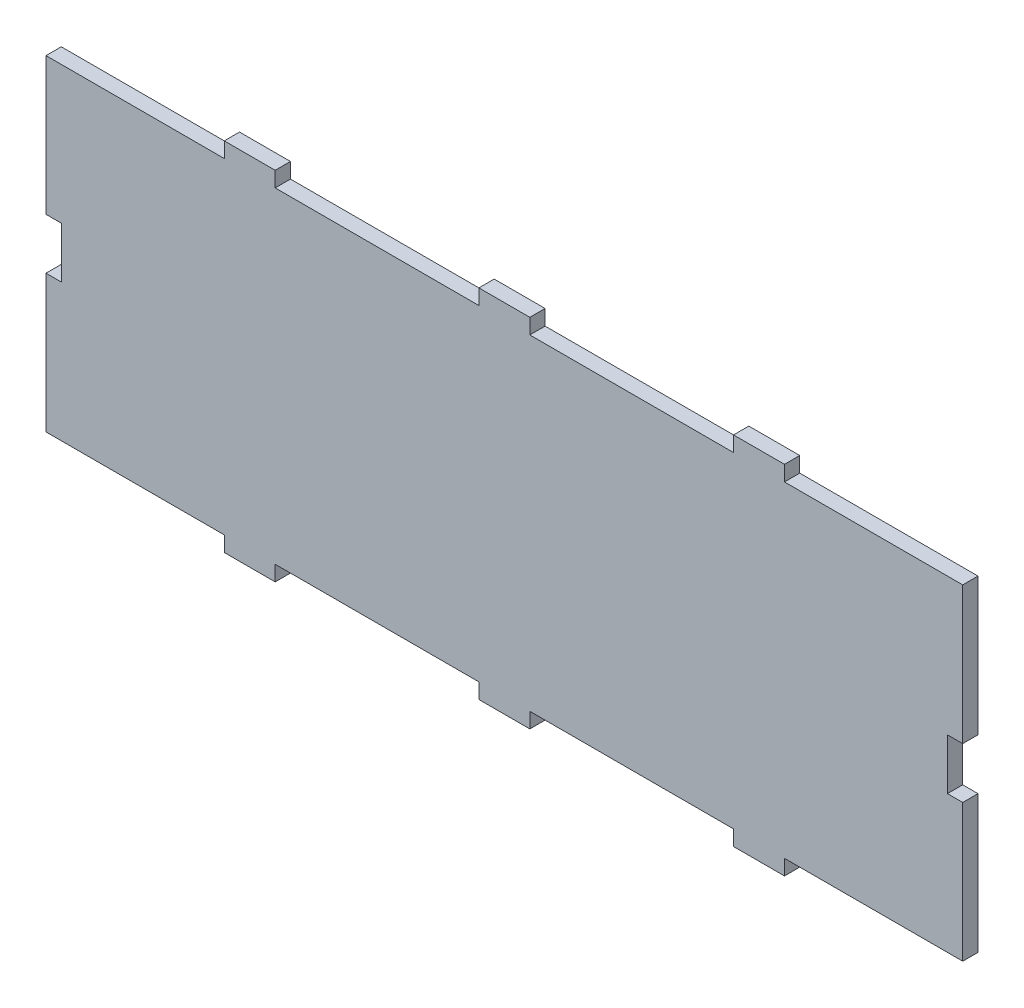
ISO-10303-21;
HEADER;
FILE_DESCRIPTION(('STEP AP214'),'2;1');
FILE_NAME('part.step','',(''),(''),'','','');
FILE_SCHEMA(('AUTOMOTIVE_DESIGN { 1 0 10303 214 1 1 1 1 }'));
ENDSEC;
DATA;
#1=APPLICATION_CONTEXT('core data for automotive mechanical design processes');
#2=APPLICATION_PROTOCOL_DEFINITION('international standard','automotive_design',2000,#1);
#3=PRODUCT_CONTEXT('',#1,'mechanical');
#4=PRODUCT('Part','Part','',(#3));
#5=PRODUCT_RELATED_PRODUCT_CATEGORY('part','',(#4));
#6=PRODUCT_DEFINITION_FORMATION('','',#4);
#7=PRODUCT_DEFINITION_CONTEXT('part definition',#1,'design');
#8=PRODUCT_DEFINITION('design','',#6,#7);
#9=PRODUCT_DEFINITION_SHAPE('','',#8);
#10=(LENGTH_UNIT() NAMED_UNIT(*) SI_UNIT(.MILLI.,.METRE.));
#11=(NAMED_UNIT(*) PLANE_ANGLE_UNIT() SI_UNIT($,.RADIAN.));
#12=(NAMED_UNIT(*) SI_UNIT($,.STERADIAN.) SOLID_ANGLE_UNIT());
#13=UNCERTAINTY_MEASURE_WITH_UNIT(LENGTH_MEASURE(1.E-05),#10,'distance_accuracy_value','');
#14=(GEOMETRIC_REPRESENTATION_CONTEXT(3) GLOBAL_UNCERTAINTY_ASSIGNED_CONTEXT((#13)) GLOBAL_UNIT_ASSIGNED_CONTEXT((#10,
#11,#12)) REPRESENTATION_CONTEXT('',''));
#15=CARTESIAN_POINT('',(0.,0.,0.));
#16=DIRECTION('',(0.,0.,1.));
#17=DIRECTION('',(1.,0.,0.));
#18=AXIS2_PLACEMENT_3D('',#15,#16,#17);
#19=CARTESIAN_POINT('',(90.,-35.,3.));
#20=DIRECTION('',(-1.,0.,0.));
#21=DIRECTION('',(0.,0.,1.));
#22=AXIS2_PLACEMENT_3D('',#19,#20,#21);
#23=PLANE('',#22);
#24=DIRECTION('',(0.,0.,1.));
#25=VECTOR('',#24,1.);
#26=CARTESIAN_POINT('',(90.,-32.,-7.));
#27=LINE('',#26,#25);
#28=CARTESIAN_POINT('',(90.,-32.,0.));
#29=VERTEX_POINT('',#28);
#30=CARTESIAN_POINT('',(90.,-32.,3.));
#31=VERTEX_POINT('',#30);
#32=EDGE_CURVE('E355',#29,#31,#27,.T.);
#33=ORIENTED_EDGE('',*,*,#32,.F.);
#34=DIRECTION('',(0.,1.,0.));
#35=VECTOR('',#34,1.);
#36=CARTESIAN_POINT('',(90.,-35.,0.));
#37=LINE('',#36,#35);
#38=CARTESIAN_POINT('',(90.,-5.,0.));
#39=VERTEX_POINT('',#38);
#40=EDGE_CURVE('E475',#29,#39,#37,.T.);
#41=ORIENTED_EDGE('',*,*,#40,.T.);
#42=DIRECTION('',(0.,0.,1.));
#43=VECTOR('',#42,1.);
#44=CARTESIAN_POINT('',(90.,-5.,0.));
#45=LINE('',#44,#43);
#46=CARTESIAN_POINT('',(90.,-5.,3.));
#47=VERTEX_POINT('',#46);
#48=EDGE_CURVE('E456',#39,#47,#45,.T.);
#49=ORIENTED_EDGE('',*,*,#48,.T.);
#50=DIRECTION('',(0.,1.,0.));
#51=VECTOR('',#50,1.);
#52=CARTESIAN_POINT('',(90.,-35.,3.));
#53=LINE('',#52,#51);
#54=EDGE_CURVE('E460',#31,#47,#53,.T.);
#55=ORIENTED_EDGE('',*,*,#54,.F.);
#56=EDGE_LOOP('',(#33,#41,#49,#55));
#57=FACE_BOUND('',#56,.T.);
#58=ADVANCED_FACE('F39',(#57),#23,.F.);
#59=CARTESIAN_POINT('',(-90.,-35.,3.));
#60=DIRECTION('',(1.,0.,0.));
#61=DIRECTION('',(0.,0.,-1.));
#62=AXIS2_PLACEMENT_3D('',#59,#60,#61);
#63=PLANE('',#62);
#64=DIRECTION('',(0.,0.,1.));
#65=VECTOR('',#64,1.);
#66=CARTESIAN_POINT('',(-90.,32.,-7.));
#67=LINE('',#66,#65);
#68=CARTESIAN_POINT('',(-90.,32.,0.));
#69=VERTEX_POINT('',#68);
#70=CARTESIAN_POINT('',(-90.,32.,3.));
#71=VERTEX_POINT('',#70);
#72=EDGE_CURVE('E373',#69,#71,#67,.T.);
#73=ORIENTED_EDGE('',*,*,#72,.F.);
#74=DIRECTION('',(0.,-1.,0.));
#75=VECTOR('',#74,1.);
#76=CARTESIAN_POINT('',(-90.,-35.,0.));
#77=LINE('',#76,#75);
#78=CARTESIAN_POINT('',(-90.,5.,0.));
#79=VERTEX_POINT('',#78);
#80=EDGE_CURVE('E482',#69,#79,#77,.T.);
#81=ORIENTED_EDGE('',*,*,#80,.T.);
#82=DIRECTION('',(0.,0.,1.));
#83=VECTOR('',#82,1.);
#84=CARTESIAN_POINT('',(-90.,5.,0.));
#85=LINE('',#84,#83);
#86=CARTESIAN_POINT('',(-90.,5.,3.));
#87=VERTEX_POINT('',#86);
#88=EDGE_CURVE('E428',#79,#87,#85,.T.);
#89=ORIENTED_EDGE('',*,*,#88,.T.);
#90=DIRECTION('',(0.,-1.,0.));
#91=VECTOR('',#90,1.);
#92=CARTESIAN_POINT('',(-90.,-35.,3.));
#93=LINE('',#92,#91);
#94=EDGE_CURVE('E468',#71,#87,#93,.T.);
#95=ORIENTED_EDGE('',*,*,#94,.F.);
#96=EDGE_LOOP('',(#73,#81,#89,#95));
#97=FACE_BOUND('',#96,.T.);
#98=ADVANCED_FACE('F597',(#97),#63,.F.);
#99=CARTESIAN_POINT('',(0.,0.,3.));
#100=DIRECTION('',(0.,0.,-1.));
#101=DIRECTION('',(-1.,0.,0.));
#102=AXIS2_PLACEMENT_3D('',#99,#100,#101);
#103=PLANE('',#102);
#104=DIRECTION('',(-1.,0.,0.));
#105=VECTOR('',#104,1.);
#106=CARTESIAN_POINT('',(0.,32.,3.));
#107=LINE('',#106,#105);
#108=CARTESIAN_POINT('',(-4.99999999999999,32.,3.));
#109=VERTEX_POINT('',#108);
#110=CARTESIAN_POINT('',(-45.,32.,3.));
#111=VERTEX_POINT('',#110);
#112=EDGE_CURVE('E326',#109,#111,#107,.T.);
#113=ORIENTED_EDGE('',*,*,#112,.T.);
#114=DIRECTION('',(0.,-1.,0.));
#115=VECTOR('',#114,1.);
#116=CARTESIAN_POINT('',(-45.,0.,3.));
#117=LINE('',#116,#115);
#118=CARTESIAN_POINT('',(-45.,35.,3.));
#119=VERTEX_POINT('',#118);
#120=EDGE_CURVE('E330',#119,#111,#117,.T.);
#121=ORIENTED_EDGE('',*,*,#120,.F.);
#122=DIRECTION('',(-1.,0.,0.));
#123=VECTOR('',#122,1.);
#124=CARTESIAN_POINT('',(-90.,35.,3.));
#125=LINE('',#124,#123);
#126=CARTESIAN_POINT('',(-55.,35.,3.));
#127=VERTEX_POINT('',#126);
#128=EDGE_CURVE('E462',#119,#127,#125,.T.);
#129=ORIENTED_EDGE('',*,*,#128,.T.);
#130=DIRECTION('',(0.,-1.,0.));
#131=VECTOR('',#130,1.);
#132=CARTESIAN_POINT('',(-55.,0.,3.));
#133=LINE('',#132,#131);
#134=CARTESIAN_POINT('',(-55.,32.,3.));
#135=VERTEX_POINT('',#134);
#136=EDGE_CURVE('E54',#127,#135,#133,.T.);
#137=ORIENTED_EDGE('',*,*,#136,.T.);
#138=DIRECTION('',(-1.,0.,0.));
#139=VECTOR('',#138,1.);
#140=CARTESIAN_POINT('',(0.,32.,3.));
#141=LINE('',#140,#139);
#142=EDGE_CURVE('E336',#135,#71,#141,.T.);
#143=ORIENTED_EDGE('',*,*,#142,.T.);
#144=ORIENTED_EDGE('',*,*,#94,.T.);
#145=DIRECTION('',(1.,0.,0.));
#146=VECTOR('',#145,1.);
#147=CARTESIAN_POINT('',(0.,5.,3.));
#148=LINE('',#147,#146);
#149=CARTESIAN_POINT('',(-87.,5.,3.));
#150=VERTEX_POINT('',#149);
#151=EDGE_CURVE('E413',#87,#150,#148,.T.);
#152=ORIENTED_EDGE('',*,*,#151,.T.);
#153=DIRECTION('',(0.,1.,0.));
#154=VECTOR('',#153,1.);
#155=CARTESIAN_POINT('',(-87.,0.,3.));
#156=LINE('',#155,#154);
#157=CARTESIAN_POINT('',(-87.,-5.,3.));
#158=VERTEX_POINT('',#157);
#159=EDGE_CURVE('E422',#158,#150,#156,.T.);
#160=ORIENTED_EDGE('',*,*,#159,.F.);
#161=DIRECTION('',(1.,0.,0.));
#162=VECTOR('',#161,1.);
#163=CARTESIAN_POINT('',(0.,-5.,3.));
#164=LINE('',#163,#162);
#165=CARTESIAN_POINT('',(-90.,-5.,3.));
#166=VERTEX_POINT('',#165);
#167=EDGE_CURVE('E419',#166,#158,#164,.T.);
#168=ORIENTED_EDGE('',*,*,#167,.F.);
#169=CARTESIAN_POINT('',(-90.,-32.,3.));
#170=VERTEX_POINT('',#169);
#171=EDGE_CURVE('E471',#166,#170,#93,.T.);
#172=ORIENTED_EDGE('',*,*,#171,.T.);
#173=DIRECTION('',(-1.,0.,0.));
#174=VECTOR('',#173,1.);
#175=CARTESIAN_POINT('',(0.,-32.,3.));
#176=LINE('',#175,#174);
#177=CARTESIAN_POINT('',(-55.,-32.,3.));
#178=VERTEX_POINT('',#177);
#179=EDGE_CURVE('E320',#178,#170,#176,.T.);
#180=ORIENTED_EDGE('',*,*,#179,.F.);
#181=DIRECTION('',(0.,1.,0.));
#182=VECTOR('',#181,1.);
#183=CARTESIAN_POINT('',(-55.,0.,3.));
#184=LINE('',#183,#182);
#185=CARTESIAN_POINT('',(-55.,-35.,3.));
#186=VERTEX_POINT('',#185);
#187=EDGE_CURVE('E317',#186,#178,#184,.T.);
#188=ORIENTED_EDGE('',*,*,#187,.F.);
#189=DIRECTION('',(1.,0.,0.));
#190=VECTOR('',#189,1.);
#191=CARTESIAN_POINT('',(-90.,-35.,3.));
#192=LINE('',#191,#190);
#193=CARTESIAN_POINT('',(-45.,-35.,3.));
#194=VERTEX_POINT('',#193);
#195=EDGE_CURVE('E474',#186,#194,#192,.T.);
#196=ORIENTED_EDGE('',*,*,#195,.T.);
#197=DIRECTION('',(0.,1.,0.));
#198=VECTOR('',#197,1.);
#199=CARTESIAN_POINT('',(-45.,0.,3.));
#200=LINE('',#199,#198);
#201=CARTESIAN_POINT('',(-45.,-32.,3.));
#202=VERTEX_POINT('',#201);
#203=EDGE_CURVE('E307',#194,#202,#200,.T.);
#204=ORIENTED_EDGE('',*,*,#203,.T.);
#205=DIRECTION('',(1.,0.,0.));
#206=VECTOR('',#205,1.);
#207=CARTESIAN_POINT('',(0.,-32.,3.));
#208=LINE('',#207,#206);
#209=CARTESIAN_POINT('',(-4.99999999999999,-32.,3.));
#210=VERTEX_POINT('',#209);
#211=EDGE_CURVE('E304',#202,#210,#208,.T.);
#212=ORIENTED_EDGE('',*,*,#211,.T.);
#213=DIRECTION('',(0.,1.,0.));
#214=VECTOR('',#213,1.);
#215=CARTESIAN_POINT('',(-4.99999999999999,0.,3.));
#216=LINE('',#215,#214);
#217=CARTESIAN_POINT('',(-4.99999999999999,-35.,3.));
#218=VERTEX_POINT('',#217);
#219=EDGE_CURVE('E311',#218,#210,#216,.T.);
#220=ORIENTED_EDGE('',*,*,#219,.F.);
#221=CARTESIAN_POINT('',(4.99999999999998,-35.,3.));
#222=VERTEX_POINT('',#221);
#223=EDGE_CURVE('E298',#218,#222,#192,.T.);
#224=ORIENTED_EDGE('',*,*,#223,.T.);
#225=DIRECTION('',(0.,1.,0.));
#226=VECTOR('',#225,1.);
#227=CARTESIAN_POINT('',(5.00000000000001,0.,3.));
#228=LINE('',#227,#226);
#229=CARTESIAN_POINT('',(5.00000000000001,-32.,3.));
#230=VERTEX_POINT('',#229);
#231=EDGE_CURVE('E275',#222,#230,#228,.T.);
#232=ORIENTED_EDGE('',*,*,#231,.T.);
#233=DIRECTION('',(1.,0.,0.));
#234=VECTOR('',#233,1.);
#235=CARTESIAN_POINT('',(0.,-32.,3.));
#236=LINE('',#235,#234);
#237=CARTESIAN_POINT('',(45.,-32.,3.));
#238=VERTEX_POINT('',#237);
#239=EDGE_CURVE('E285',#230,#238,#236,.T.);
#240=ORIENTED_EDGE('',*,*,#239,.T.);
#241=DIRECTION('',(0.,1.,0.));
#242=VECTOR('',#241,1.);
#243=CARTESIAN_POINT('',(45.,0.,3.));
#244=LINE('',#243,#242);
#245=CARTESIAN_POINT('',(45.,-35.,3.));
#246=VERTEX_POINT('',#245);
#247=EDGE_CURVE('E282',#246,#238,#244,.T.);
#248=ORIENTED_EDGE('',*,*,#247,.F.);
#249=CARTESIAN_POINT('',(55.,-35.,3.));
#250=VERTEX_POINT('',#249);
#251=EDGE_CURVE('E470',#246,#250,#192,.T.);
#252=ORIENTED_EDGE('',*,*,#251,.T.);
#253=DIRECTION('',(0.,1.,0.));
#254=VECTOR('',#253,1.);
#255=CARTESIAN_POINT('',(55.,0.,3.));
#256=LINE('',#255,#254);
#257=CARTESIAN_POINT('',(55.,-32.,3.));
#258=VERTEX_POINT('',#257);
#259=EDGE_CURVE('E363',#250,#258,#256,.T.);
#260=ORIENTED_EDGE('',*,*,#259,.T.);
#261=DIRECTION('',(1.,0.,0.));
#262=VECTOR('',#261,1.);
#263=CARTESIAN_POINT('',(0.,-32.,3.));
#264=LINE('',#263,#262);
#265=EDGE_CURVE('E302',#258,#31,#264,.T.);
#266=ORIENTED_EDGE('',*,*,#265,.T.);
#267=ORIENTED_EDGE('',*,*,#54,.T.);
#268=DIRECTION('',(-1.,0.,0.));
#269=VECTOR('',#268,1.);
#270=CARTESIAN_POINT('',(0.,-5.,3.));
#271=LINE('',#270,#269);
#272=CARTESIAN_POINT('',(87.,-5.,3.));
#273=VERTEX_POINT('',#272);
#274=EDGE_CURVE('E448',#47,#273,#271,.T.);
#275=ORIENTED_EDGE('',*,*,#274,.T.);
#276=DIRECTION('',(0.,1.,0.));
#277=VECTOR('',#276,1.);
#278=CARTESIAN_POINT('',(87.,0.,3.));
#279=LINE('',#278,#277);
#280=CARTESIAN_POINT('',(87.,5.,3.));
#281=VERTEX_POINT('',#280);
#282=EDGE_CURVE('E408',#273,#281,#279,.T.);
#283=ORIENTED_EDGE('',*,*,#282,.T.);
#284=DIRECTION('',(-1.,0.,0.));
#285=VECTOR('',#284,1.);
#286=CARTESIAN_POINT('',(0.,5.,3.));
#287=LINE('',#286,#285);
#288=CARTESIAN_POINT('',(90.,5.,3.));
#289=VERTEX_POINT('',#288);
#290=EDGE_CURVE('E440',#289,#281,#287,.T.);
#291=ORIENTED_EDGE('',*,*,#290,.F.);
#292=CARTESIAN_POINT('',(90.,32.,3.));
#293=VERTEX_POINT('',#292);
#294=EDGE_CURVE('E463',#289,#293,#53,.T.);
#295=ORIENTED_EDGE('',*,*,#294,.T.);
#296=DIRECTION('',(1.,0.,0.));
#297=VECTOR('',#296,1.);
#298=CARTESIAN_POINT('',(0.,32.,3.));
#299=LINE('',#298,#297);
#300=CARTESIAN_POINT('',(55.,32.,3.));
#301=VERTEX_POINT('',#300);
#302=EDGE_CURVE('E354',#301,#293,#299,.T.);
#303=ORIENTED_EDGE('',*,*,#302,.F.);
#304=DIRECTION('',(0.,-1.,0.));
#305=VECTOR('',#304,1.);
#306=CARTESIAN_POINT('',(55.,0.,3.));
#307=LINE('',#306,#305);
#308=CARTESIAN_POINT('',(55.,35.,3.));
#309=VERTEX_POINT('',#308);
#310=EDGE_CURVE('E351',#309,#301,#307,.T.);
#311=ORIENTED_EDGE('',*,*,#310,.F.);
#312=CARTESIAN_POINT('',(45.,35.,3.));
#313=VERTEX_POINT('',#312);
#314=EDGE_CURVE('E467',#309,#313,#125,.T.);
#315=ORIENTED_EDGE('',*,*,#314,.T.);
#316=DIRECTION('',(0.,-1.,0.));
#317=VECTOR('',#316,1.);
#318=CARTESIAN_POINT('',(45.,0.,3.));
#319=LINE('',#318,#317);
#320=CARTESIAN_POINT('',(45.,32.,3.));
#321=VERTEX_POINT('',#320);
#322=EDGE_CURVE('E345',#313,#321,#319,.T.);
#323=ORIENTED_EDGE('',*,*,#322,.T.);
#324=DIRECTION('',(1.,0.,0.));
#325=VECTOR('',#324,1.);
#326=CARTESIAN_POINT('',(0.,32.,3.));
#327=LINE('',#326,#325);
#328=CARTESIAN_POINT('',(5.00000000000001,32.,3.));
#329=VERTEX_POINT('',#328);
#330=EDGE_CURVE('E341',#329,#321,#327,.T.);
#331=ORIENTED_EDGE('',*,*,#330,.F.);
#332=DIRECTION('',(0.,-1.,0.));
#333=VECTOR('',#332,1.);
#334=CARTESIAN_POINT('',(5.00000000000001,0.,3.));
#335=LINE('',#334,#333);
#336=CARTESIAN_POINT('',(5.00000000000001,35.,3.));
#337=VERTEX_POINT('',#336);
#338=EDGE_CURVE('E338',#337,#329,#335,.T.);
#339=ORIENTED_EDGE('',*,*,#338,.F.);
#340=CARTESIAN_POINT('',(-5.00000000000002,35.,3.));
#341=VERTEX_POINT('',#340);
#342=EDGE_CURVE('E466',#337,#341,#125,.T.);
#343=ORIENTED_EDGE('',*,*,#342,.T.);
#344=DIRECTION('',(0.,-1.,0.));
#345=VECTOR('',#344,1.);
#346=CARTESIAN_POINT('',(-4.99999999999999,0.,3.));
#347=LINE('',#346,#345);
#348=EDGE_CURVE('E62',#341,#109,#347,.T.);
#349=ORIENTED_EDGE('',*,*,#348,.T.);
#350=EDGE_LOOP('',(#113,#121,#129,#137,#143,#144,#152,#160,#168,#172,#180,#188,#196,#204,#212,
#220,#224,#232,#240,#248,#252,#260,#266,#267,#275,#283,#291,#295,#303,#311,#315,#323,#331,#339,
#343,#349));
#351=FACE_BOUND('',#350,.T.);
#352=ADVANCED_FACE('F295',(#351),#103,.F.);
#353=CARTESIAN_POINT('',(0.,0.,0.));
#354=DIRECTION('',(0.,0.,-1.));
#355=DIRECTION('',(-1.,0.,0.));
#356=AXIS2_PLACEMENT_3D('',#353,#354,#355);
#357=PLANE('',#356);
#358=DIRECTION('',(0.,1.,0.));
#359=VECTOR('',#358,1.);
#360=CARTESIAN_POINT('',(-45.,0.,0.));
#361=LINE('',#360,#359);
#362=CARTESIAN_POINT('',(-45.,32.,0.));
#363=VERTEX_POINT('',#362);
#364=CARTESIAN_POINT('',(-45.,35.,0.));
#365=VERTEX_POINT('',#364);
#366=EDGE_CURVE('E404',#363,#365,#361,.T.);
#367=ORIENTED_EDGE('',*,*,#366,.F.);
#368=DIRECTION('',(1.,0.,0.));
#369=VECTOR('',#368,1.);
#370=CARTESIAN_POINT('',(0.,32.,0.));
#371=LINE('',#370,#369);
#372=CARTESIAN_POINT('',(-4.99999999999999,32.,0.));
#373=VERTEX_POINT('',#372);
#374=EDGE_CURVE('E11',#363,#373,#371,.T.);
#375=ORIENTED_EDGE('',*,*,#374,.T.);
#376=DIRECTION('',(0.,1.,0.));
#377=VECTOR('',#376,1.);
#378=CARTESIAN_POINT('',(-4.99999999999999,0.,0.));
#379=LINE('',#378,#377);
#380=CARTESIAN_POINT('',(-4.99999999999999,35.,0.));
#381=VERTEX_POINT('',#380);
#382=EDGE_CURVE('E401',#373,#381,#379,.T.);
#383=ORIENTED_EDGE('',*,*,#382,.T.);
#384=DIRECTION('',(-1.,0.,0.));
#385=VECTOR('',#384,1.);
#386=CARTESIAN_POINT('',(-90.,35.,0.));
#387=LINE('',#386,#385);
#388=CARTESIAN_POINT('',(5.00000000000001,35.,0.));
#389=VERTEX_POINT('',#388);
#390=EDGE_CURVE('E480',#389,#381,#387,.T.);
#391=ORIENTED_EDGE('',*,*,#390,.F.);
#392=DIRECTION('',(0.,1.,0.));
#393=VECTOR('',#392,1.);
#394=CARTESIAN_POINT('',(5.00000000000001,0.,0.));
#395=LINE('',#394,#393);
#396=CARTESIAN_POINT('',(5.00000000000001,32.,0.));
#397=VERTEX_POINT('',#396);
#398=EDGE_CURVE('E399',#397,#389,#395,.T.);
#399=ORIENTED_EDGE('',*,*,#398,.F.);
#400=DIRECTION('',(-1.,0.,0.));
#401=VECTOR('',#400,1.);
#402=CARTESIAN_POINT('',(0.,32.,0.));
#403=LINE('',#402,#401);
#404=CARTESIAN_POINT('',(45.,32.,0.));
#405=VERTEX_POINT('',#404);
#406=EDGE_CURVE('E47',#405,#397,#403,.T.);
#407=ORIENTED_EDGE('',*,*,#406,.F.);
#408=DIRECTION('',(0.,1.,0.));
#409=VECTOR('',#408,1.);
#410=CARTESIAN_POINT('',(45.,0.,0.));
#411=LINE('',#410,#409);
#412=CARTESIAN_POINT('',(45.,35.,0.));
#413=VERTEX_POINT('',#412);
#414=EDGE_CURVE('E396',#405,#413,#411,.T.);
#415=ORIENTED_EDGE('',*,*,#414,.T.);
#416=CARTESIAN_POINT('',(55.,35.,0.));
#417=VERTEX_POINT('',#416);
#418=EDGE_CURVE('E481',#417,#413,#387,.T.);
#419=ORIENTED_EDGE('',*,*,#418,.F.);
#420=DIRECTION('',(0.,1.,0.));
#421=VECTOR('',#420,1.);
#422=CARTESIAN_POINT('',(55.,0.,0.));
#423=LINE('',#422,#421);
#424=CARTESIAN_POINT('',(55.,32.,0.));
#425=VERTEX_POINT('',#424);
#426=EDGE_CURVE('E394',#425,#417,#423,.T.);
#427=ORIENTED_EDGE('',*,*,#426,.F.);
#428=DIRECTION('',(-1.,0.,0.));
#429=VECTOR('',#428,1.);
#430=CARTESIAN_POINT('',(0.,32.,0.));
#431=LINE('',#430,#429);
#432=CARTESIAN_POINT('',(90.,32.,0.));
#433=VERTEX_POINT('',#432);
#434=EDGE_CURVE('E406',#433,#425,#431,.T.);
#435=ORIENTED_EDGE('',*,*,#434,.F.);
#436=CARTESIAN_POINT('',(90.,5.,0.));
#437=VERTEX_POINT('',#436);
#438=EDGE_CURVE('E431',#437,#433,#37,.T.);
#439=ORIENTED_EDGE('',*,*,#438,.F.);
#440=DIRECTION('',(-1.,0.,0.));
#441=VECTOR('',#440,1.);
#442=CARTESIAN_POINT('',(0.,5.,0.));
#443=LINE('',#442,#441);
#444=CARTESIAN_POINT('',(87.,5.,0.));
#445=VERTEX_POINT('',#444);
#446=EDGE_CURVE('E442',#437,#445,#443,.T.);
#447=ORIENTED_EDGE('',*,*,#446,.T.);
#448=DIRECTION('',(0.,1.,0.));
#449=VECTOR('',#448,1.);
#450=CARTESIAN_POINT('',(87.,0.,0.));
#451=LINE('',#450,#449);
#452=CARTESIAN_POINT('',(87.,-5.,0.));
#453=VERTEX_POINT('',#452);
#454=EDGE_CURVE('E437',#453,#445,#451,.T.);
#455=ORIENTED_EDGE('',*,*,#454,.F.);
#456=DIRECTION('',(-1.,0.,0.));
#457=VECTOR('',#456,1.);
#458=CARTESIAN_POINT('',(0.,-5.,0.));
#459=LINE('',#458,#457);
#460=EDGE_CURVE('E439',#39,#453,#459,.T.);
#461=ORIENTED_EDGE('',*,*,#460,.F.);
#462=ORIENTED_EDGE('',*,*,#40,.F.);
#463=DIRECTION('',(-1.,0.,0.));
#464=VECTOR('',#463,1.);
#465=CARTESIAN_POINT('',(0.,-32.,0.));
#466=LINE('',#465,#464);
#467=CARTESIAN_POINT('',(55.,-32.,0.));
#468=VERTEX_POINT('',#467);
#469=EDGE_CURVE('E528',#29,#468,#466,.T.);
#470=ORIENTED_EDGE('',*,*,#469,.T.);
#471=DIRECTION('',(0.,-1.,0.));
#472=VECTOR('',#471,1.);
#473=CARTESIAN_POINT('',(55.,0.,0.));
#474=LINE('',#473,#472);
#475=CARTESIAN_POINT('',(55.,-35.,0.));
#476=VERTEX_POINT('',#475);
#477=EDGE_CURVE('E386',#468,#476,#474,.T.);
#478=ORIENTED_EDGE('',*,*,#477,.T.);
#479=DIRECTION('',(1.,0.,0.));
#480=VECTOR('',#479,1.);
#481=CARTESIAN_POINT('',(-90.,-35.,0.));
#482=LINE('',#481,#480);
#483=CARTESIAN_POINT('',(45.,-35.,0.));
#484=VERTEX_POINT('',#483);
#485=EDGE_CURVE('E484',#484,#476,#482,.T.);
#486=ORIENTED_EDGE('',*,*,#485,.F.);
#487=DIRECTION('',(0.,-1.,0.));
#488=VECTOR('',#487,1.);
#489=CARTESIAN_POINT('',(45.,0.,0.));
#490=LINE('',#489,#488);
#491=CARTESIAN_POINT('',(45.,-32.,0.));
#492=VERTEX_POINT('',#491);
#493=EDGE_CURVE('E384',#492,#484,#490,.T.);
#494=ORIENTED_EDGE('',*,*,#493,.F.);
#495=DIRECTION('',(-1.,0.,0.));
#496=VECTOR('',#495,1.);
#497=CARTESIAN_POINT('',(0.,-32.,0.));
#498=LINE('',#497,#496);
#499=CARTESIAN_POINT('',(5.00000000000001,-32.,0.));
#500=VERTEX_POINT('',#499);
#501=EDGE_CURVE('E526',#492,#500,#498,.T.);
#502=ORIENTED_EDGE('',*,*,#501,.T.);
#503=DIRECTION('',(0.,-1.,0.));
#504=VECTOR('',#503,1.);
#505=CARTESIAN_POINT('',(5.00000000000001,0.,0.));
#506=LINE('',#505,#504);
#507=CARTESIAN_POINT('',(5.00000000000001,-35.,0.));
#508=VERTEX_POINT('',#507);
#509=EDGE_CURVE('E278',#500,#508,#506,.T.);
#510=ORIENTED_EDGE('',*,*,#509,.T.);
#511=CARTESIAN_POINT('',(-4.99999999999999,-35.,0.));
#512=VERTEX_POINT('',#511);
#513=EDGE_CURVE('E488',#512,#508,#482,.T.);
#514=ORIENTED_EDGE('',*,*,#513,.F.);
#515=DIRECTION('',(0.,-1.,0.));
#516=VECTOR('',#515,1.);
#517=CARTESIAN_POINT('',(-4.99999999999999,0.,0.));
#518=LINE('',#517,#516);
#519=CARTESIAN_POINT('',(-4.99999999999999,-32.,0.));
#520=VERTEX_POINT('',#519);
#521=EDGE_CURVE('E381',#520,#512,#518,.T.);
#522=ORIENTED_EDGE('',*,*,#521,.F.);
#523=DIRECTION('',(-1.,0.,0.));
#524=VECTOR('',#523,1.);
#525=CARTESIAN_POINT('',(0.,-32.,0.));
#526=LINE('',#525,#524);
#527=CARTESIAN_POINT('',(-45.,-32.,0.));
#528=VERTEX_POINT('',#527);
#529=EDGE_CURVE('E523',#520,#528,#526,.T.);
#530=ORIENTED_EDGE('',*,*,#529,.T.);
#531=DIRECTION('',(0.,-1.,0.));
#532=VECTOR('',#531,1.);
#533=CARTESIAN_POINT('',(-45.,0.,0.));
#534=LINE('',#533,#532);
#535=CARTESIAN_POINT('',(-45.,-35.,0.));
#536=VERTEX_POINT('',#535);
#537=EDGE_CURVE('E378',#528,#536,#534,.T.);
#538=ORIENTED_EDGE('',*,*,#537,.T.);
#539=CARTESIAN_POINT('',(-55.,-35.,0.));
#540=VERTEX_POINT('',#539);
#541=EDGE_CURVE('E489',#540,#536,#482,.T.);
#542=ORIENTED_EDGE('',*,*,#541,.F.);
#543=DIRECTION('',(0.,-1.,0.));
#544=VECTOR('',#543,1.);
#545=CARTESIAN_POINT('',(-55.,0.,0.));
#546=LINE('',#545,#544);
#547=CARTESIAN_POINT('',(-55.,-32.,0.));
#548=VERTEX_POINT('',#547);
#549=EDGE_CURVE('E375',#548,#540,#546,.T.);
#550=ORIENTED_EDGE('',*,*,#549,.F.);
#551=DIRECTION('',(1.,0.,0.));
#552=VECTOR('',#551,1.);
#553=CARTESIAN_POINT('',(0.,-32.,0.));
#554=LINE('',#553,#552);
#555=CARTESIAN_POINT('',(-90.,-32.,0.));
#556=VERTEX_POINT('',#555);
#557=EDGE_CURVE('E389',#556,#548,#554,.T.);
#558=ORIENTED_EDGE('',*,*,#557,.F.);
#559=CARTESIAN_POINT('',(-90.,-5.,0.));
#560=VERTEX_POINT('',#559);
#561=EDGE_CURVE('E485',#560,#556,#77,.T.);
#562=ORIENTED_EDGE('',*,*,#561,.F.);
#563=DIRECTION('',(1.,0.,0.));
#564=VECTOR('',#563,1.);
#565=CARTESIAN_POINT('',(0.,-5.,0.));
#566=LINE('',#565,#564);
#567=CARTESIAN_POINT('',(-87.,-5.,0.));
#568=VERTEX_POINT('',#567);
#569=EDGE_CURVE('E409',#560,#568,#566,.T.);
#570=ORIENTED_EDGE('',*,*,#569,.T.);
#571=DIRECTION('',(0.,1.,0.));
#572=VECTOR('',#571,1.);
#573=CARTESIAN_POINT('',(-87.,0.,0.));
#574=LINE('',#573,#572);
#575=CARTESIAN_POINT('',(-87.,5.,0.));
#576=VERTEX_POINT('',#575);
#577=EDGE_CURVE('E412',#568,#576,#574,.T.);
#578=ORIENTED_EDGE('',*,*,#577,.T.);
#579=DIRECTION('',(1.,0.,0.));
#580=VECTOR('',#579,1.);
#581=CARTESIAN_POINT('',(0.,5.,0.));
#582=LINE('',#581,#580);
#583=EDGE_CURVE('E416',#79,#576,#582,.T.);
#584=ORIENTED_EDGE('',*,*,#583,.F.);
#585=ORIENTED_EDGE('',*,*,#80,.F.);
#586=DIRECTION('',(1.,0.,0.));
#587=VECTOR('',#586,1.);
#588=CARTESIAN_POINT('',(0.,32.,0.));
#589=LINE('',#588,#587);
#590=CARTESIAN_POINT('',(-55.,32.,0.));
#591=VERTEX_POINT('',#590);
#592=EDGE_CURVE('E520',#69,#591,#589,.T.);
#593=ORIENTED_EDGE('',*,*,#592,.T.);
#594=DIRECTION('',(0.,1.,0.));
#595=VECTOR('',#594,1.);
#596=CARTESIAN_POINT('',(-55.,0.,0.));
#597=LINE('',#596,#595);
#598=CARTESIAN_POINT('',(-55.,35.,0.));
#599=VERTEX_POINT('',#598);
#600=EDGE_CURVE('E391',#591,#599,#597,.T.);
#601=ORIENTED_EDGE('',*,*,#600,.T.);
#602=EDGE_CURVE('E477',#365,#599,#387,.T.);
#603=ORIENTED_EDGE('',*,*,#602,.F.);
#604=EDGE_LOOP('',(#367,#375,#383,#391,#399,#407,#415,#419,#427,#435,#439,#447,#455,#461,#462,
#470,#478,#486,#494,#502,#510,#514,#522,#530,#538,#542,#550,#558,#562,#570,#578,#584,#585,#593,
#601,#603));
#605=FACE_BOUND('',#604,.T.);
#606=ADVANCED_FACE('F543',(#605),#357,.T.);
#607=CARTESIAN_POINT('',(-90.,35.,3.));
#608=DIRECTION('',(0.,-1.,0.));
#609=DIRECTION('',(0.,0.,-1.));
#610=AXIS2_PLACEMENT_3D('',#607,#608,#609);
#611=PLANE('',#610);
#612=DIRECTION('',(0.,0.,-1.));
#613=VECTOR('',#612,1.);
#614=CARTESIAN_POINT('',(-4.99999999999999,35.,3.));
#615=LINE('',#614,#613);
#616=EDGE_CURVE('E515',#341,#381,#615,.T.);
#617=ORIENTED_EDGE('',*,*,#616,.F.);
#618=ORIENTED_EDGE('',*,*,#342,.F.);
#619=DIRECTION('',(0.,0.,-1.));
#620=VECTOR('',#619,1.);
#621=CARTESIAN_POINT('',(5.,35.,3.));
#622=LINE('',#621,#620);
#623=EDGE_CURVE('E512',#337,#389,#622,.T.);
#624=ORIENTED_EDGE('',*,*,#623,.T.);
#625=ORIENTED_EDGE('',*,*,#390,.T.);
#626=EDGE_LOOP('',(#617,#618,#624,#625));
#627=FACE_BOUND('',#626,.T.);
#628=ADVANCED_FACE('F576',(#627),#611,.F.);
#629=DIRECTION('',(0.,0.,-1.));
#630=VECTOR('',#629,1.);
#631=CARTESIAN_POINT('',(45.,35.,3.));
#632=LINE('',#631,#630);
#633=EDGE_CURVE('E510',#313,#413,#632,.T.);
#634=ORIENTED_EDGE('',*,*,#633,.F.);
#635=ORIENTED_EDGE('',*,*,#314,.F.);
#636=DIRECTION('',(0.,0.,-1.));
#637=VECTOR('',#636,1.);
#638=CARTESIAN_POINT('',(55.,35.,3.));
#639=LINE('',#638,#637);
#640=EDGE_CURVE('E507',#309,#417,#639,.T.);
#641=ORIENTED_EDGE('',*,*,#640,.T.);
#642=ORIENTED_EDGE('',*,*,#418,.T.);
#643=EDGE_LOOP('',(#634,#635,#641,#642));
#644=FACE_BOUND('',#643,.T.);
#645=ADVANCED_FACE('F697',(#644),#611,.F.);
#646=ORIENTED_EDGE('',*,*,#128,.F.);
#647=DIRECTION('',(0.,0.,-1.));
#648=VECTOR('',#647,1.);
#649=CARTESIAN_POINT('',(-45.,35.,3.));
#650=LINE('',#649,#648);
#651=EDGE_CURVE('E517',#119,#365,#650,.T.);
#652=ORIENTED_EDGE('',*,*,#651,.T.);
#653=ORIENTED_EDGE('',*,*,#602,.T.);
#654=DIRECTION('',(0.,0.,-1.));
#655=VECTOR('',#654,1.);
#656=CARTESIAN_POINT('',(-55.,35.,3.));
#657=LINE('',#656,#655);
#658=EDGE_CURVE('E505',#127,#599,#657,.T.);
#659=ORIENTED_EDGE('',*,*,#658,.F.);
#660=EDGE_LOOP('',(#646,#652,#653,#659));
#661=FACE_BOUND('',#660,.T.);
#662=ADVANCED_FACE('F589',(#661),#611,.F.);
#663=CARTESIAN_POINT('',(-90.,-35.,3.));
#664=DIRECTION('',(0.,1.,0.));
#665=DIRECTION('',(0.,0.,1.));
#666=AXIS2_PLACEMENT_3D('',#663,#664,#665);
#667=PLANE('',#666);
#668=DIRECTION('',(0.,0.,-1.));
#669=VECTOR('',#668,1.);
#670=CARTESIAN_POINT('',(55.,-35.,3.));
#671=LINE('',#670,#669);
#672=EDGE_CURVE('E503',#250,#476,#671,.T.);
#673=ORIENTED_EDGE('',*,*,#672,.F.);
#674=ORIENTED_EDGE('',*,*,#251,.F.);
#675=DIRECTION('',(0.,0.,-1.));
#676=VECTOR('',#675,1.);
#677=CARTESIAN_POINT('',(45.,-35.,3.));
#678=LINE('',#677,#676);
#679=EDGE_CURVE('E500',#246,#484,#678,.T.);
#680=ORIENTED_EDGE('',*,*,#679,.T.);
#681=ORIENTED_EDGE('',*,*,#485,.T.);
#682=EDGE_LOOP('',(#673,#674,#680,#681));
#683=FACE_BOUND('',#682,.T.);
#684=ADVANCED_FACE('F636',(#683),#667,.F.);
#685=DIRECTION('',(0.,0.,-1.));
#686=VECTOR('',#685,1.);
#687=CARTESIAN_POINT('',(5.,-35.,3.));
#688=LINE('',#687,#686);
#689=EDGE_CURVE('E498',#222,#508,#688,.T.);
#690=ORIENTED_EDGE('',*,*,#689,.F.);
#691=ORIENTED_EDGE('',*,*,#223,.F.);
#692=DIRECTION('',(0.,0.,-1.));
#693=VECTOR('',#692,1.);
#694=CARTESIAN_POINT('',(-4.99999999999999,-35.,3.));
#695=LINE('',#694,#693);
#696=EDGE_CURVE('E495',#218,#512,#695,.T.);
#697=ORIENTED_EDGE('',*,*,#696,.T.);
#698=ORIENTED_EDGE('',*,*,#513,.T.);
#699=EDGE_LOOP('',(#690,#691,#697,#698));
#700=FACE_BOUND('',#699,.T.);
#701=ADVANCED_FACE('F633',(#700),#667,.F.);
#702=DIRECTION('',(0.,0.,-1.));
#703=VECTOR('',#702,1.);
#704=CARTESIAN_POINT('',(-45.,-35.,3.));
#705=LINE('',#704,#703);
#706=EDGE_CURVE('E493',#194,#536,#705,.T.);
#707=ORIENTED_EDGE('',*,*,#706,.F.);
#708=ORIENTED_EDGE('',*,*,#195,.F.);
#709=DIRECTION('',(0.,0.,-1.));
#710=VECTOR('',#709,1.);
#711=CARTESIAN_POINT('',(-55.,-35.,3.));
#712=LINE('',#711,#710);
#713=EDGE_CURVE('E490',#186,#540,#712,.T.);
#714=ORIENTED_EDGE('',*,*,#713,.T.);
#715=ORIENTED_EDGE('',*,*,#541,.T.);
#716=EDGE_LOOP('',(#707,#708,#714,#715));
#717=FACE_BOUND('',#716,.T.);
#718=ADVANCED_FACE('F626',(#717),#667,.F.);
#719=ORIENTED_EDGE('',*,*,#438,.T.);
#720=DIRECTION('',(0.,0.,1.));
#721=VECTOR('',#720,1.);
#722=CARTESIAN_POINT('',(90.,32.,-7.));
#723=LINE('',#722,#721);
#724=EDGE_CURVE('E342',#433,#293,#723,.T.);
#725=ORIENTED_EDGE('',*,*,#724,.T.);
#726=ORIENTED_EDGE('',*,*,#294,.F.);
#727=DIRECTION('',(0.,0.,1.));
#728=VECTOR('',#727,1.);
#729=CARTESIAN_POINT('',(90.,5.,0.));
#730=LINE('',#729,#728);
#731=EDGE_CURVE('E454',#437,#289,#730,.T.);
#732=ORIENTED_EDGE('',*,*,#731,.F.);
#733=EDGE_LOOP('',(#719,#725,#726,#732));
#734=FACE_BOUND('',#733,.T.);
#735=ADVANCED_FACE('F41',(#734),#23,.F.);
#736=ORIENTED_EDGE('',*,*,#561,.T.);
#737=DIRECTION('',(0.,0.,1.));
#738=VECTOR('',#737,1.);
#739=CARTESIAN_POINT('',(-90.,-32.,-7.));
#740=LINE('',#739,#738);
#741=EDGE_CURVE('E308',#556,#170,#740,.T.);
#742=ORIENTED_EDGE('',*,*,#741,.T.);
#743=ORIENTED_EDGE('',*,*,#171,.F.);
#744=DIRECTION('',(0.,0.,1.));
#745=VECTOR('',#744,1.);
#746=CARTESIAN_POINT('',(-90.,-5.,0.));
#747=LINE('',#746,#745);
#748=EDGE_CURVE('E418',#560,#166,#747,.T.);
#749=ORIENTED_EDGE('',*,*,#748,.F.);
#750=EDGE_LOOP('',(#736,#742,#743,#749));
#751=FACE_BOUND('',#750,.T.);
#752=ADVANCED_FACE('F554',(#751),#63,.F.);
#753=CARTESIAN_POINT('',(87.,0.,0.));
#754=DIRECTION('',(1.,0.,0.));
#755=DIRECTION('',(0.,0.,-1.));
#756=AXIS2_PLACEMENT_3D('',#753,#754,#755);
#757=PLANE('',#756);
#758=ORIENTED_EDGE('',*,*,#282,.F.);
#759=DIRECTION('',(0.,0.,1.));
#760=VECTOR('',#759,1.);
#761=CARTESIAN_POINT('',(87.,-5.,0.));
#762=LINE('',#761,#760);
#763=EDGE_CURVE('E445',#453,#273,#762,.T.);
#764=ORIENTED_EDGE('',*,*,#763,.F.);
#765=ORIENTED_EDGE('',*,*,#454,.T.);
#766=DIRECTION('',(0.,0.,1.));
#767=VECTOR('',#766,1.);
#768=CARTESIAN_POINT('',(87.,5.,0.));
#769=LINE('',#768,#767);
#770=EDGE_CURVE('E423',#445,#281,#769,.T.);
#771=ORIENTED_EDGE('',*,*,#770,.T.);
#772=EDGE_LOOP('',(#758,#764,#765,#771));
#773=FACE_BOUND('',#772,.T.);
#774=ADVANCED_FACE('F632',(#773),#757,.T.);
#775=CARTESIAN_POINT('',(0.,5.,0.));
#776=DIRECTION('',(0.,1.,0.));
#777=DIRECTION('',(0.,0.,1.));
#778=AXIS2_PLACEMENT_3D('',#775,#776,#777);
#779=PLANE('',#778);
#780=ORIENTED_EDGE('',*,*,#290,.T.);
#781=ORIENTED_EDGE('',*,*,#770,.F.);
#782=ORIENTED_EDGE('',*,*,#446,.F.);
#783=ORIENTED_EDGE('',*,*,#731,.T.);
#784=EDGE_LOOP('',(#780,#781,#782,#783));
#785=FACE_BOUND('',#784,.T.);
#786=ADVANCED_FACE('F683',(#785),#779,.F.);
#787=CARTESIAN_POINT('',(0.,-5.,0.));
#788=DIRECTION('',(0.,1.,0.));
#789=DIRECTION('',(0.,0.,1.));
#790=AXIS2_PLACEMENT_3D('',#787,#788,#789);
#791=PLANE('',#790);
#792=ORIENTED_EDGE('',*,*,#274,.F.);
#793=ORIENTED_EDGE('',*,*,#48,.F.);
#794=ORIENTED_EDGE('',*,*,#460,.T.);
#795=ORIENTED_EDGE('',*,*,#763,.T.);
#796=EDGE_LOOP('',(#792,#793,#794,#795));
#797=FACE_BOUND('',#796,.T.);
#798=ADVANCED_FACE('F677',(#797),#791,.T.);
#799=CARTESIAN_POINT('',(0.,5.,0.));
#800=DIRECTION('',(0.,-1.,0.));
#801=DIRECTION('',(0.,0.,-1.));
#802=AXIS2_PLACEMENT_3D('',#799,#800,#801);
#803=PLANE('',#802);
#804=ORIENTED_EDGE('',*,*,#151,.F.);
#805=ORIENTED_EDGE('',*,*,#88,.F.);
#806=ORIENTED_EDGE('',*,*,#583,.T.);
#807=DIRECTION('',(0.,0.,1.));
#808=VECTOR('',#807,1.);
#809=CARTESIAN_POINT('',(-87.,5.,0.));
#810=LINE('',#809,#808);
#811=EDGE_CURVE('E432',#576,#150,#810,.T.);
#812=ORIENTED_EDGE('',*,*,#811,.T.);
#813=EDGE_LOOP('',(#804,#805,#806,#812));
#814=FACE_BOUND('',#813,.T.);
#815=ADVANCED_FACE('F602',(#814),#803,.T.);
#816=CARTESIAN_POINT('',(-87.,0.,0.));
#817=DIRECTION('',(1.,0.,0.));
#818=DIRECTION('',(0.,0.,-1.));
#819=AXIS2_PLACEMENT_3D('',#816,#817,#818);
#820=PLANE('',#819);
#821=ORIENTED_EDGE('',*,*,#159,.T.);
#822=ORIENTED_EDGE('',*,*,#811,.F.);
#823=ORIENTED_EDGE('',*,*,#577,.F.);
#824=DIRECTION('',(0.,0.,1.));
#825=VECTOR('',#824,1.);
#826=CARTESIAN_POINT('',(-87.,-5.,0.));
#827=LINE('',#826,#825);
#828=EDGE_CURVE('E434',#568,#158,#827,.T.);
#829=ORIENTED_EDGE('',*,*,#828,.T.);
#830=EDGE_LOOP('',(#821,#822,#823,#829));
#831=FACE_BOUND('',#830,.T.);
#832=ADVANCED_FACE('F606',(#831),#820,.F.);
#833=CARTESIAN_POINT('',(0.,-5.,0.));
#834=DIRECTION('',(0.,-1.,0.));
#835=DIRECTION('',(0.,0.,-1.));
#836=AXIS2_PLACEMENT_3D('',#833,#834,#835);
#837=PLANE('',#836);
#838=ORIENTED_EDGE('',*,*,#167,.T.);
#839=ORIENTED_EDGE('',*,*,#828,.F.);
#840=ORIENTED_EDGE('',*,*,#569,.F.);
#841=ORIENTED_EDGE('',*,*,#748,.T.);
#842=EDGE_LOOP('',(#838,#839,#840,#841));
#843=FACE_BOUND('',#842,.T.);
#844=ADVANCED_FACE('F608',(#843),#837,.F.);
#845=CARTESIAN_POINT('',(-55.,0.,-7.));
#846=DIRECTION('',(1.,0.,0.));
#847=DIRECTION('',(0.,0.,-1.));
#848=AXIS2_PLACEMENT_3D('',#845,#846,#847);
#849=PLANE('',#848);
#850=ORIENTED_EDGE('',*,*,#549,.T.);
#851=ORIENTED_EDGE('',*,*,#713,.F.);
#852=ORIENTED_EDGE('',*,*,#187,.T.);
#853=DIRECTION('',(0.,0.,1.));
#854=VECTOR('',#853,1.);
#855=CARTESIAN_POINT('',(-55.,-32.,-7.));
#856=LINE('',#855,#854);
#857=EDGE_CURVE('E322',#548,#178,#856,.T.);
#858=ORIENTED_EDGE('',*,*,#857,.F.);
#859=EDGE_LOOP('',(#850,#851,#852,#858));
#860=FACE_BOUND('',#859,.T.);
#861=ADVANCED_FACE('F564',(#860),#849,.F.);
#862=CARTESIAN_POINT('',(0.,-32.,-7.));
#863=DIRECTION('',(0.,1.,0.));
#864=DIRECTION('',(0.,0.,1.));
#865=AXIS2_PLACEMENT_3D('',#862,#863,#864);
#866=PLANE('',#865);
#867=ORIENTED_EDGE('',*,*,#557,.T.);
#868=ORIENTED_EDGE('',*,*,#857,.T.);
#869=ORIENTED_EDGE('',*,*,#179,.T.);
#870=ORIENTED_EDGE('',*,*,#741,.F.);
#871=EDGE_LOOP('',(#867,#868,#869,#870));
#872=FACE_BOUND('',#871,.T.);
#873=ADVANCED_FACE('F562',(#872),#866,.F.);
#874=CARTESIAN_POINT('',(0.,-32.,-7.));
#875=DIRECTION('',(0.,-1.,0.));
#876=DIRECTION('',(0.,0.,-1.));
#877=AXIS2_PLACEMENT_3D('',#874,#875,#876);
#878=PLANE('',#877);
#879=DIRECTION('',(0.,0.,1.));
#880=VECTOR('',#879,1.);
#881=CARTESIAN_POINT('',(-4.99999999999999,-32.,-7.));
#882=LINE('',#881,#880);
#883=EDGE_CURVE('E291',#520,#210,#882,.T.);
#884=ORIENTED_EDGE('',*,*,#883,.T.);
#885=ORIENTED_EDGE('',*,*,#211,.F.);
#886=DIRECTION('',(0.,0.,1.));
#887=VECTOR('',#886,1.);
#888=CARTESIAN_POINT('',(-45.,-32.,-7.));
#889=LINE('',#888,#887);
#890=EDGE_CURVE('E314',#528,#202,#889,.T.);
#891=ORIENTED_EDGE('',*,*,#890,.F.);
#892=ORIENTED_EDGE('',*,*,#529,.F.);
#893=EDGE_LOOP('',(#884,#885,#891,#892));
#894=FACE_BOUND('',#893,.T.);
#895=ADVANCED_FACE('F775',(#894),#878,.T.);
#896=CARTESIAN_POINT('',(-4.99999999999999,0.,-7.));
#897=DIRECTION('',(1.,0.,0.));
#898=DIRECTION('',(0.,0.,-1.));
#899=AXIS2_PLACEMENT_3D('',#896,#897,#898);
#900=PLANE('',#899);
#901=ORIENTED_EDGE('',*,*,#521,.T.);
#902=ORIENTED_EDGE('',*,*,#696,.F.);
#903=ORIENTED_EDGE('',*,*,#219,.T.);
#904=ORIENTED_EDGE('',*,*,#883,.F.);
#905=EDGE_LOOP('',(#901,#902,#903,#904));
#906=FACE_BOUND('',#905,.T.);
#907=ADVANCED_FACE('F783',(#906),#900,.F.);
#908=CARTESIAN_POINT('',(-45.,0.,-7.));
#909=DIRECTION('',(1.,0.,0.));
#910=DIRECTION('',(0.,0.,-1.));
#911=AXIS2_PLACEMENT_3D('',#908,#909,#910);
#912=PLANE('',#911);
#913=ORIENTED_EDGE('',*,*,#890,.T.);
#914=ORIENTED_EDGE('',*,*,#203,.F.);
#915=ORIENTED_EDGE('',*,*,#706,.T.);
#916=ORIENTED_EDGE('',*,*,#537,.F.);
#917=EDGE_LOOP('',(#913,#914,#915,#916));
#918=FACE_BOUND('',#917,.T.);
#919=ADVANCED_FACE('F793',(#918),#912,.T.);
#920=CARTESIAN_POINT('',(0.,-32.,-7.));
#921=DIRECTION('',(0.,-1.,0.));
#922=DIRECTION('',(0.,0.,-1.));
#923=AXIS2_PLACEMENT_3D('',#920,#921,#922);
#924=PLANE('',#923);
#925=DIRECTION('',(0.,0.,1.));
#926=VECTOR('',#925,1.);
#927=CARTESIAN_POINT('',(45.,-32.,-7.));
#928=LINE('',#927,#926);
#929=EDGE_CURVE('E281',#492,#238,#928,.T.);
#930=ORIENTED_EDGE('',*,*,#929,.T.);
#931=ORIENTED_EDGE('',*,*,#239,.F.);
#932=DIRECTION('',(0.,0.,1.));
#933=VECTOR('',#932,1.);
#934=CARTESIAN_POINT('',(5.00000000000001,-32.,-7.));
#935=LINE('',#934,#933);
#936=EDGE_CURVE('E271',#500,#230,#935,.T.);
#937=ORIENTED_EDGE('',*,*,#936,.F.);
#938=ORIENTED_EDGE('',*,*,#501,.F.);
#939=EDGE_LOOP('',(#930,#931,#937,#938));
#940=FACE_BOUND('',#939,.T.);
#941=ADVANCED_FACE('F286',(#940),#924,.T.);
#942=CARTESIAN_POINT('',(45.,0.,-7.));
#943=DIRECTION('',(1.,0.,0.));
#944=DIRECTION('',(0.,0.,-1.));
#945=AXIS2_PLACEMENT_3D('',#942,#943,#944);
#946=PLANE('',#945);
#947=ORIENTED_EDGE('',*,*,#493,.T.);
#948=ORIENTED_EDGE('',*,*,#679,.F.);
#949=ORIENTED_EDGE('',*,*,#247,.T.);
#950=ORIENTED_EDGE('',*,*,#929,.F.);
#951=EDGE_LOOP('',(#947,#948,#949,#950));
#952=FACE_BOUND('',#951,.T.);
#953=ADVANCED_FACE('F661',(#952),#946,.F.);
#954=CARTESIAN_POINT('',(5.00000000000001,0.,-7.));
#955=DIRECTION('',(1.,0.,0.));
#956=DIRECTION('',(0.,0.,-1.));
#957=AXIS2_PLACEMENT_3D('',#954,#955,#956);
#958=PLANE('',#957);
#959=ORIENTED_EDGE('',*,*,#936,.T.);
#960=ORIENTED_EDGE('',*,*,#231,.F.);
#961=ORIENTED_EDGE('',*,*,#689,.T.);
#962=ORIENTED_EDGE('',*,*,#509,.F.);
#963=EDGE_LOOP('',(#959,#960,#961,#962));
#964=FACE_BOUND('',#963,.T.);
#965=ADVANCED_FACE('F273',(#964),#958,.T.);
#966=CARTESIAN_POINT('',(0.,-32.,-7.));
#967=DIRECTION('',(0.,-1.,0.));
#968=DIRECTION('',(0.,0.,-1.));
#969=AXIS2_PLACEMENT_3D('',#966,#967,#968);
#970=PLANE('',#969);
#971=ORIENTED_EDGE('',*,*,#32,.T.);
#972=ORIENTED_EDGE('',*,*,#265,.F.);
#973=DIRECTION('',(0.,0.,1.));
#974=VECTOR('',#973,1.);
#975=CARTESIAN_POINT('',(55.,-32.,-7.));
#976=LINE('',#975,#974);
#977=EDGE_CURVE('E366',#468,#258,#976,.T.);
#978=ORIENTED_EDGE('',*,*,#977,.F.);
#979=ORIENTED_EDGE('',*,*,#469,.F.);
#980=EDGE_LOOP('',(#971,#972,#978,#979));
#981=FACE_BOUND('',#980,.T.);
#982=ADVANCED_FACE('F671',(#981),#970,.T.);
#983=CARTESIAN_POINT('',(55.,0.,-7.));
#984=DIRECTION('',(1.,0.,0.));
#985=DIRECTION('',(0.,0.,-1.));
#986=AXIS2_PLACEMENT_3D('',#983,#984,#985);
#987=PLANE('',#986);
#988=ORIENTED_EDGE('',*,*,#977,.T.);
#989=ORIENTED_EDGE('',*,*,#259,.F.);
#990=ORIENTED_EDGE('',*,*,#672,.T.);
#991=ORIENTED_EDGE('',*,*,#477,.F.);
#992=EDGE_LOOP('',(#988,#989,#990,#991));
#993=FACE_BOUND('',#992,.T.);
#994=ADVANCED_FACE('F666',(#993),#987,.T.);
#995=CARTESIAN_POINT('',(0.,32.,-7.));
#996=DIRECTION('',(0.,1.,0.));
#997=DIRECTION('',(0.,0.,1.));
#998=AXIS2_PLACEMENT_3D('',#995,#996,#997);
#999=PLANE('',#998);
#1000=ORIENTED_EDGE('',*,*,#72,.T.);
#1001=ORIENTED_EDGE('',*,*,#142,.F.);
#1002=DIRECTION('',(0.,0.,1.));
#1003=VECTOR('',#1002,1.);
#1004=CARTESIAN_POINT('',(-55.,32.,-7.));
#1005=LINE('',#1004,#1003);
#1006=EDGE_CURVE('E372',#591,#135,#1005,.T.);
#1007=ORIENTED_EDGE('',*,*,#1006,.F.);
#1008=ORIENTED_EDGE('',*,*,#592,.F.);
#1009=EDGE_LOOP('',(#1000,#1001,#1007,#1008));
#1010=FACE_BOUND('',#1009,.T.);
#1011=ADVANCED_FACE('F840',(#1010),#999,.T.);
#1012=CARTESIAN_POINT('',(-55.,0.,-7.));
#1013=DIRECTION('',(-1.,0.,0.));
#1014=DIRECTION('',(0.,0.,1.));
#1015=AXIS2_PLACEMENT_3D('',#1012,#1013,#1014);
#1016=PLANE('',#1015);
#1017=ORIENTED_EDGE('',*,*,#1006,.T.);
#1018=ORIENTED_EDGE('',*,*,#136,.F.);
#1019=ORIENTED_EDGE('',*,*,#658,.T.);
#1020=ORIENTED_EDGE('',*,*,#600,.F.);
#1021=EDGE_LOOP('',(#1017,#1018,#1019,#1020));
#1022=FACE_BOUND('',#1021,.T.);
#1023=ADVANCED_FACE('F847',(#1022),#1016,.T.);
#1024=CARTESIAN_POINT('',(55.,0.,-7.));
#1025=DIRECTION('',(-1.,0.,0.));
#1026=DIRECTION('',(0.,0.,1.));
#1027=AXIS2_PLACEMENT_3D('',#1024,#1025,#1026);
#1028=PLANE('',#1027);
#1029=ORIENTED_EDGE('',*,*,#426,.T.);
#1030=ORIENTED_EDGE('',*,*,#640,.F.);
#1031=ORIENTED_EDGE('',*,*,#310,.T.);
#1032=DIRECTION('',(0.,0.,1.));
#1033=VECTOR('',#1032,1.);
#1034=CARTESIAN_POINT('',(55.,32.,-7.));
#1035=LINE('',#1034,#1033);
#1036=EDGE_CURVE('E357',#425,#301,#1035,.T.);
#1037=ORIENTED_EDGE('',*,*,#1036,.F.);
#1038=EDGE_LOOP('',(#1029,#1030,#1031,#1037));
#1039=FACE_BOUND('',#1038,.T.);
#1040=ADVANCED_FACE('F649',(#1039),#1028,.F.);
#1041=CARTESIAN_POINT('',(0.,32.,-7.));
#1042=DIRECTION('',(0.,-1.,0.));
#1043=DIRECTION('',(0.,0.,-1.));
#1044=AXIS2_PLACEMENT_3D('',#1041,#1042,#1043);
#1045=PLANE('',#1044);
#1046=ORIENTED_EDGE('',*,*,#434,.T.);
#1047=ORIENTED_EDGE('',*,*,#1036,.T.);
#1048=ORIENTED_EDGE('',*,*,#302,.T.);
#1049=ORIENTED_EDGE('',*,*,#724,.F.);
#1050=EDGE_LOOP('',(#1046,#1047,#1048,#1049));
#1051=FACE_BOUND('',#1050,.T.);
#1052=ADVANCED_FACE('F647',(#1051),#1045,.F.);
#1053=CARTESIAN_POINT('',(5.00000000000001,0.,-7.));
#1054=DIRECTION('',(-1.,0.,0.));
#1055=DIRECTION('',(0.,0.,1.));
#1056=AXIS2_PLACEMENT_3D('',#1053,#1054,#1055);
#1057=PLANE('',#1056);
#1058=ORIENTED_EDGE('',*,*,#398,.T.);
#1059=ORIENTED_EDGE('',*,*,#623,.F.);
#1060=ORIENTED_EDGE('',*,*,#338,.T.);
#1061=DIRECTION('',(0.,0.,1.));
#1062=VECTOR('',#1061,1.);
#1063=CARTESIAN_POINT('',(5.00000000000001,32.,-7.));
#1064=LINE('',#1063,#1062);
#1065=EDGE_CURVE('E348',#397,#329,#1064,.T.);
#1066=ORIENTED_EDGE('',*,*,#1065,.F.);
#1067=EDGE_LOOP('',(#1058,#1059,#1060,#1066));
#1068=FACE_BOUND('',#1067,.T.);
#1069=ADVANCED_FACE('F538',(#1068),#1057,.F.);
#1070=CARTESIAN_POINT('',(45.,0.,-7.));
#1071=DIRECTION('',(-1.,0.,0.));
#1072=DIRECTION('',(0.,0.,1.));
#1073=AXIS2_PLACEMENT_3D('',#1070,#1071,#1072);
#1074=PLANE('',#1073);
#1075=DIRECTION('',(0.,0.,1.));
#1076=VECTOR('',#1075,1.);
#1077=CARTESIAN_POINT('',(45.,32.,-7.));
#1078=LINE('',#1077,#1076);
#1079=EDGE_CURVE('E328',#405,#321,#1078,.T.);
#1080=ORIENTED_EDGE('',*,*,#1079,.T.);
#1081=ORIENTED_EDGE('',*,*,#322,.F.);
#1082=ORIENTED_EDGE('',*,*,#633,.T.);
#1083=ORIENTED_EDGE('',*,*,#414,.F.);
#1084=EDGE_LOOP('',(#1080,#1081,#1082,#1083));
#1085=FACE_BOUND('',#1084,.T.);
#1086=ADVANCED_FACE('F877',(#1085),#1074,.T.);
#1087=CARTESIAN_POINT('',(0.,32.,-7.));
#1088=DIRECTION('',(0.,-1.,0.));
#1089=DIRECTION('',(0.,0.,-1.));
#1090=AXIS2_PLACEMENT_3D('',#1087,#1088,#1089);
#1091=PLANE('',#1090);
#1092=ORIENTED_EDGE('',*,*,#406,.T.);
#1093=ORIENTED_EDGE('',*,*,#1065,.T.);
#1094=ORIENTED_EDGE('',*,*,#330,.T.);
#1095=ORIENTED_EDGE('',*,*,#1079,.F.);
#1096=EDGE_LOOP('',(#1092,#1093,#1094,#1095));
#1097=FACE_BOUND('',#1096,.T.);
#1098=ADVANCED_FACE('F534',(#1097),#1091,.F.);
#1099=CARTESIAN_POINT('',(0.,32.,-7.));
#1100=DIRECTION('',(0.,1.,0.));
#1101=DIRECTION('',(0.,0.,1.));
#1102=AXIS2_PLACEMENT_3D('',#1099,#1100,#1101);
#1103=PLANE('',#1102);
#1104=DIRECTION('',(0.,0.,1.));
#1105=VECTOR('',#1104,1.);
#1106=CARTESIAN_POINT('',(-45.,32.,-7.));
#1107=LINE('',#1106,#1105);
#1108=EDGE_CURVE('E334',#363,#111,#1107,.T.);
#1109=ORIENTED_EDGE('',*,*,#1108,.T.);
#1110=ORIENTED_EDGE('',*,*,#112,.F.);
#1111=DIRECTION('',(0.,0.,1.));
#1112=VECTOR('',#1111,1.);
#1113=CARTESIAN_POINT('',(-4.99999999999999,32.,-7.));
#1114=LINE('',#1113,#1112);
#1115=EDGE_CURVE('E333',#373,#109,#1114,.T.);
#1116=ORIENTED_EDGE('',*,*,#1115,.F.);
#1117=ORIENTED_EDGE('',*,*,#374,.F.);
#1118=EDGE_LOOP('',(#1109,#1110,#1116,#1117));
#1119=FACE_BOUND('',#1118,.T.);
#1120=ADVANCED_FACE('F581',(#1119),#1103,.T.);
#1121=CARTESIAN_POINT('',(-45.,0.,-7.));
#1122=DIRECTION('',(-1.,0.,0.));
#1123=DIRECTION('',(0.,0.,1.));
#1124=AXIS2_PLACEMENT_3D('',#1121,#1122,#1123);
#1125=PLANE('',#1124);
#1126=ORIENTED_EDGE('',*,*,#366,.T.);
#1127=ORIENTED_EDGE('',*,*,#651,.F.);
#1128=ORIENTED_EDGE('',*,*,#120,.T.);
#1129=ORIENTED_EDGE('',*,*,#1108,.F.);
#1130=EDGE_LOOP('',(#1126,#1127,#1128,#1129));
#1131=FACE_BOUND('',#1130,.T.);
#1132=ADVANCED_FACE('F585',(#1131),#1125,.F.);
#1133=CARTESIAN_POINT('',(-4.99999999999999,0.,-7.));
#1134=DIRECTION('',(-1.,0.,0.));
#1135=DIRECTION('',(0.,0.,1.));
#1136=AXIS2_PLACEMENT_3D('',#1133,#1134,#1135);
#1137=PLANE('',#1136);
#1138=ORIENTED_EDGE('',*,*,#1115,.T.);
#1139=ORIENTED_EDGE('',*,*,#348,.F.);
#1140=ORIENTED_EDGE('',*,*,#616,.T.);
#1141=ORIENTED_EDGE('',*,*,#382,.F.);
#1142=EDGE_LOOP('',(#1138,#1139,#1140,#1141));
#1143=FACE_BOUND('',#1142,.T.);
#1144=ADVANCED_FACE('F577',(#1143),#1137,.T.);
#1145=CLOSED_SHELL('',(#58,#98,#352,#606,#628,#645,#662,#684,#701,#718,#735,#752,#774,#786,#798,
#815,#832,#844,#861,#873,#895,#907,#919,#941,#953,#965,#982,#994,#1011,#1023,#1040,#1052,#1069,
#1086,#1098,#1120,#1132,#1144));
#1146=MANIFOLD_SOLID_BREP('B2',#1145);
#1147=ADVANCED_BREP_SHAPE_REPRESENTATION('',(#18,#1146),#14);
#1148=SHAPE_DEFINITION_REPRESENTATION(#9,#1147);
ENDSEC;
END-ISO-10303-21;
